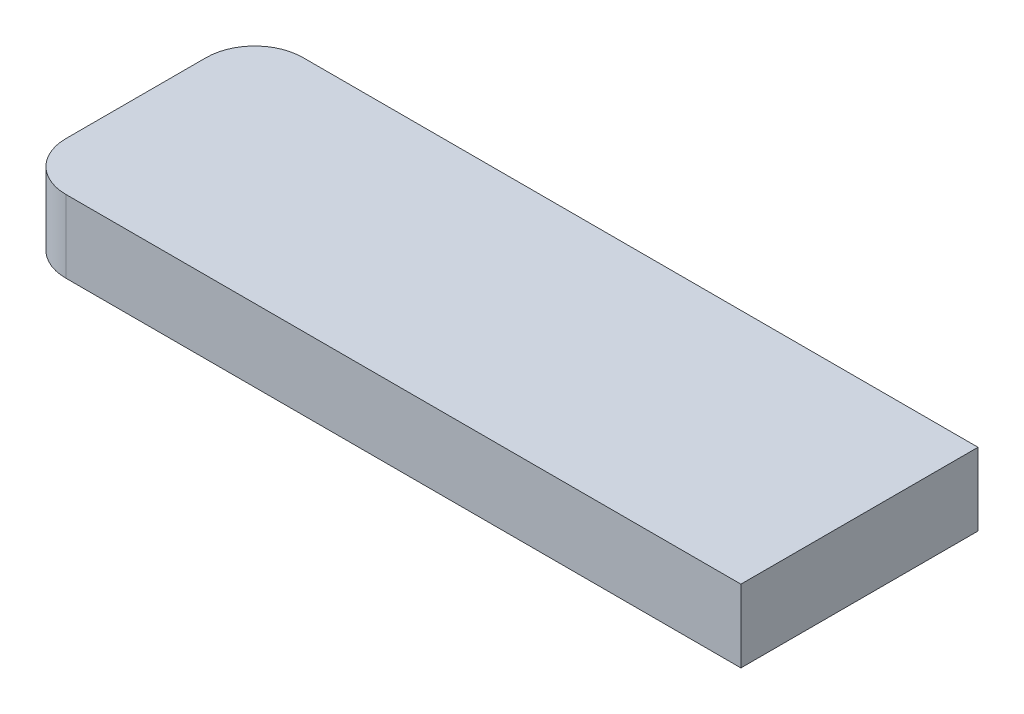
ISO-10303-21;
HEADER;
FILE_DESCRIPTION(('STEP AP214'),'2;1');
FILE_NAME('part.step','',(''),(''),'','','');
FILE_SCHEMA(('AUTOMOTIVE_DESIGN { 1 0 10303 214 1 1 1 1 }'));
ENDSEC;
DATA;
#1=APPLICATION_CONTEXT('core data for automotive mechanical design processes');
#2=APPLICATION_PROTOCOL_DEFINITION('international standard','automotive_design',2000,#1);
#3=PRODUCT_CONTEXT('',#1,'mechanical');
#4=PRODUCT('Part','Part','',(#3));
#5=PRODUCT_RELATED_PRODUCT_CATEGORY('part','',(#4));
#6=PRODUCT_DEFINITION_FORMATION('','',#4);
#7=PRODUCT_DEFINITION_CONTEXT('part definition',#1,'design');
#8=PRODUCT_DEFINITION('design','',#6,#7);
#9=PRODUCT_DEFINITION_SHAPE('','',#8);
#10=(LENGTH_UNIT() NAMED_UNIT(*) SI_UNIT(.MILLI.,.METRE.));
#11=(NAMED_UNIT(*) PLANE_ANGLE_UNIT() SI_UNIT($,.RADIAN.));
#12=(NAMED_UNIT(*) SI_UNIT($,.STERADIAN.) SOLID_ANGLE_UNIT());
#13=UNCERTAINTY_MEASURE_WITH_UNIT(LENGTH_MEASURE(1.E-05),#10,'distance_accuracy_value','');
#14=(GEOMETRIC_REPRESENTATION_CONTEXT(3) GLOBAL_UNCERTAINTY_ASSIGNED_CONTEXT((#13)) GLOBAL_UNIT_ASSIGNED_CONTEXT((#10,
#11,#12)) REPRESENTATION_CONTEXT('',''));
#15=CARTESIAN_POINT('',(0.,0.,0.));
#16=DIRECTION('',(0.,0.,1.));
#17=DIRECTION('',(1.,0.,0.));
#18=AXIS2_PLACEMENT_3D('',#15,#16,#17);
#19=CARTESIAN_POINT('',(300.,1.71683972880179E-13,0.));
#20=DIRECTION('',(-1.,0.,0.));
#21=DIRECTION('',(0.,-1.,0.));
#22=AXIS2_PLACEMENT_3D('',#19,#20,#21);
#23=PLANE('',#22);
#24=DIRECTION('',(0.,1.,0.));
#25=VECTOR('',#24,1.);
#26=CARTESIAN_POINT('',(300.,-120.,22.9));
#27=LINE('',#26,#25);
#28=CARTESIAN_POINT('',(300.,47.,22.9));
#29=VERTEX_POINT('',#28);
#30=CARTESIAN_POINT('',(300.,50.,22.9));
#31=VERTEX_POINT('',#30);
#32=EDGE_CURVE('E85',#29,#31,#27,.T.);
#33=ORIENTED_EDGE('',*,*,#32,.F.);
#34=DIRECTION('',(0.,0.,1.));
#35=VECTOR('',#34,1.);
#36=CARTESIAN_POINT('',(300.,47.,3.));
#37=LINE('',#36,#35);
#38=CARTESIAN_POINT('',(300.,47.,13.1));
#39=VERTEX_POINT('',#38);
#40=EDGE_CURVE('E87',#39,#29,#37,.T.);
#41=ORIENTED_EDGE('',*,*,#40,.F.);
#42=DIRECTION('',(0.,1.,0.));
#43=VECTOR('',#42,1.);
#44=CARTESIAN_POINT('',(300.,-120.,13.1));
#45=LINE('',#44,#43);
#46=CARTESIAN_POINT('',(300.,50.,13.1));
#47=VERTEX_POINT('',#46);
#48=EDGE_CURVE('E11',#39,#47,#45,.T.);
#49=ORIENTED_EDGE('',*,*,#48,.T.);
#50=DIRECTION('',(0.,0.,-1.));
#51=VECTOR('',#50,1.);
#52=CARTESIAN_POINT('',(300.,50.,60.));
#53=LINE('',#52,#51);
#54=EDGE_CURVE('E47',#31,#47,#53,.T.);
#55=ORIENTED_EDGE('',*,*,#54,.F.);
#56=EDGE_LOOP('',(#33,#41,#49,#55));
#57=FACE_BOUND('',#56,.T.);
#58=ADVANCED_FACE('F32',(#57),#23,.F.);
#59=CARTESIAN_POINT('',(300.,47.,3.));
#60=DIRECTION('',(0.,1.,0.));
#61=DIRECTION('',(0.,0.,1.));
#62=AXIS2_PLACEMENT_3D('',#59,#60,#61);
#63=PLANE('',#62);
#64=DIRECTION('',(0.,0.,-1.));
#65=VECTOR('',#64,1.);
#66=CARTESIAN_POINT('',(270.1,47.,3.));
#67=LINE('',#66,#65);
#68=CARTESIAN_POINT('',(270.1,47.,20.9));
#69=VERTEX_POINT('',#68);
#70=CARTESIAN_POINT('',(270.1,47.,15.1));
#71=VERTEX_POINT('',#70);
#72=EDGE_CURVE('E138',#69,#71,#67,.T.);
#73=ORIENTED_EDGE('',*,*,#72,.T.);
#74=CARTESIAN_POINT('',(272.1,47.,15.1));
#75=DIRECTION('',(0.,1.,0.));
#76=DIRECTION('',(0.,0.,1.));
#77=AXIS2_PLACEMENT_3D('',#74,#75,#76);
#78=CIRCLE('',#77,2.);
#79=CARTESIAN_POINT('',(272.1,47.,13.1));
#80=VERTEX_POINT('',#79);
#81=EDGE_CURVE('E121',#71,#80,#78,.F.);
#82=ORIENTED_EDGE('',*,*,#81,.T.);
#83=DIRECTION('',(1.,0.,0.));
#84=VECTOR('',#83,1.);
#85=CARTESIAN_POINT('',(300.,47.,13.1));
#86=LINE('',#85,#84);
#87=EDGE_CURVE('E102',#80,#39,#86,.T.);
#88=ORIENTED_EDGE('',*,*,#87,.T.);
#89=ORIENTED_EDGE('',*,*,#40,.T.);
#90=DIRECTION('',(-1.,0.,0.));
#91=VECTOR('',#90,1.);
#92=CARTESIAN_POINT('',(300.,47.,22.9));
#93=LINE('',#92,#91);
#94=CARTESIAN_POINT('',(272.1,47.,22.9));
#95=VERTEX_POINT('',#94);
#96=EDGE_CURVE('E88',#29,#95,#93,.T.);
#97=ORIENTED_EDGE('',*,*,#96,.T.);
#98=CARTESIAN_POINT('',(272.1,47.,20.9));
#99=DIRECTION('',(0.,1.,0.));
#100=DIRECTION('',(0.,0.,1.));
#101=AXIS2_PLACEMENT_3D('',#98,#99,#100);
#102=CIRCLE('',#101,2.);
#103=EDGE_CURVE('E120',#95,#69,#102,.F.);
#104=ORIENTED_EDGE('',*,*,#103,.T.);
#105=EDGE_LOOP('',(#73,#82,#88,#89,#97,#104));
#106=FACE_BOUND('',#105,.T.);
#107=ADVANCED_FACE('F126',(#106),#63,.F.);
#108=CARTESIAN_POINT('',(-300.,50.,60.));
#109=DIRECTION('',(0.,-1.,0.));
#110=DIRECTION('',(0.,0.,-1.));
#111=AXIS2_PLACEMENT_3D('',#108,#109,#110);
#112=PLANE('',#111);
#113=DIRECTION('',(1.,0.,0.));
#114=VECTOR('',#113,1.);
#115=CARTESIAN_POINT('',(300.,50.,13.1));
#116=LINE('',#115,#114);
#117=CARTESIAN_POINT('',(272.1,50.,13.1));
#118=VERTEX_POINT('',#117);
#119=EDGE_CURVE('E105',#118,#47,#116,.T.);
#120=ORIENTED_EDGE('',*,*,#119,.F.);
#121=CARTESIAN_POINT('',(272.1,50.,15.1));
#122=DIRECTION('',(0.,-1.,0.));
#123=DIRECTION('',(0.,0.,-1.));
#124=AXIS2_PLACEMENT_3D('',#121,#122,#123);
#125=CIRCLE('',#124,2.);
#126=CARTESIAN_POINT('',(270.1,50.,15.1));
#127=VERTEX_POINT('',#126);
#128=EDGE_CURVE('E114',#118,#127,#125,.F.);
#129=ORIENTED_EDGE('',*,*,#128,.T.);
#130=DIRECTION('',(0.,0.,-1.));
#131=VECTOR('',#130,1.);
#132=CARTESIAN_POINT('',(270.1,50.,13.1));
#133=LINE('',#132,#131);
#134=CARTESIAN_POINT('',(270.1,50.,20.9));
#135=VERTEX_POINT('',#134);
#136=EDGE_CURVE('E134',#135,#127,#133,.T.);
#137=ORIENTED_EDGE('',*,*,#136,.F.);
#138=CARTESIAN_POINT('',(272.1,50.,20.9));
#139=DIRECTION('',(0.,-1.,0.));
#140=DIRECTION('',(0.,0.,-1.));
#141=AXIS2_PLACEMENT_3D('',#138,#139,#140);
#142=CIRCLE('',#141,2.);
#143=CARTESIAN_POINT('',(272.1,50.,22.9));
#144=VERTEX_POINT('',#143);
#145=EDGE_CURVE('E101',#135,#144,#142,.F.);
#146=ORIENTED_EDGE('',*,*,#145,.T.);
#147=DIRECTION('',(-1.,0.,0.));
#148=VECTOR('',#147,1.);
#149=CARTESIAN_POINT('',(300.,50.,22.9));
#150=LINE('',#149,#148);
#151=EDGE_CURVE('E94',#31,#144,#150,.T.);
#152=ORIENTED_EDGE('',*,*,#151,.F.);
#153=ORIENTED_EDGE('',*,*,#54,.T.);
#154=EDGE_LOOP('',(#120,#129,#137,#146,#152,#153));
#155=FACE_BOUND('',#154,.T.);
#156=ADVANCED_FACE('F98',(#155),#112,.F.);
#157=CARTESIAN_POINT('',(300.,-120.,22.9));
#158=DIRECTION('',(0.,0.,-1.));
#159=DIRECTION('',(-1.,0.,0.));
#160=AXIS2_PLACEMENT_3D('',#157,#158,#159);
#161=PLANE('',#160);
#162=ORIENTED_EDGE('',*,*,#151,.T.);
#163=DIRECTION('',(0.,-1.,0.));
#164=VECTOR('',#163,1.);
#165=CARTESIAN_POINT('',(272.1,-120.,22.9));
#166=LINE('',#165,#164);
#167=EDGE_CURVE('E35',#144,#95,#166,.T.);
#168=ORIENTED_EDGE('',*,*,#167,.T.);
#169=ORIENTED_EDGE('',*,*,#96,.F.);
#170=ORIENTED_EDGE('',*,*,#32,.T.);
#171=EDGE_LOOP('',(#162,#168,#169,#170));
#172=FACE_BOUND('',#171,.T.);
#173=ADVANCED_FACE('F92',(#172),#161,.F.);
#174=CARTESIAN_POINT('',(300.,-120.,13.1));
#175=DIRECTION('',(0.,0.,1.));
#176=DIRECTION('',(1.,0.,0.));
#177=AXIS2_PLACEMENT_3D('',#174,#175,#176);
#178=PLANE('',#177);
#179=ORIENTED_EDGE('',*,*,#87,.F.);
#180=DIRECTION('',(0.,1.,0.));
#181=VECTOR('',#180,1.);
#182=CARTESIAN_POINT('',(272.1,-120.,13.1));
#183=LINE('',#182,#181);
#184=EDGE_CURVE('E109',#80,#118,#183,.T.);
#185=ORIENTED_EDGE('',*,*,#184,.T.);
#186=ORIENTED_EDGE('',*,*,#119,.T.);
#187=ORIENTED_EDGE('',*,*,#48,.F.);
#188=EDGE_LOOP('',(#179,#185,#186,#187));
#189=FACE_BOUND('',#188,.T.);
#190=ADVANCED_FACE('F129',(#189),#178,.F.);
#191=CARTESIAN_POINT('',(270.1,-120.,13.1));
#192=DIRECTION('',(1.,0.,0.));
#193=DIRECTION('',(0.,0.,-1.));
#194=AXIS2_PLACEMENT_3D('',#191,#192,#193);
#195=PLANE('',#194);
#196=ORIENTED_EDGE('',*,*,#136,.T.);
#197=DIRECTION('',(0.,1.,0.));
#198=VECTOR('',#197,1.);
#199=CARTESIAN_POINT('',(270.1,-120.,15.1));
#200=LINE('',#199,#198);
#201=EDGE_CURVE('E118',#127,#71,#200,.F.);
#202=ORIENTED_EDGE('',*,*,#201,.T.);
#203=ORIENTED_EDGE('',*,*,#72,.F.);
#204=DIRECTION('',(0.,-1.,0.));
#205=VECTOR('',#204,1.);
#206=CARTESIAN_POINT('',(270.1,-120.,20.9));
#207=LINE('',#206,#205);
#208=EDGE_CURVE('E116',#69,#135,#207,.F.);
#209=ORIENTED_EDGE('',*,*,#208,.T.);
#210=EDGE_LOOP('',(#196,#202,#203,#209));
#211=FACE_BOUND('',#210,.T.);
#212=ADVANCED_FACE('F136',(#211),#195,.F.);
#213=CARTESIAN_POINT('',(272.1,-120.,15.1));
#214=DIRECTION('',(0.,1.,0.));
#215=DIRECTION('',(0.,0.,1.));
#216=AXIS2_PLACEMENT_3D('',#213,#214,#215);
#217=CYLINDRICAL_SURFACE('',#216,2.);
#218=ORIENTED_EDGE('',*,*,#81,.F.);
#219=ORIENTED_EDGE('',*,*,#201,.F.);
#220=ORIENTED_EDGE('',*,*,#128,.F.);
#221=ORIENTED_EDGE('',*,*,#184,.F.);
#222=EDGE_LOOP('',(#218,#219,#220,#221));
#223=FACE_BOUND('',#222,.T.);
#224=ADVANCED_FACE('F131',(#223),#217,.T.);
#225=CARTESIAN_POINT('',(272.1,-120.,20.9));
#226=DIRECTION('',(0.,-1.,0.));
#227=DIRECTION('',(0.,0.,-1.));
#228=AXIS2_PLACEMENT_3D('',#225,#226,#227);
#229=CYLINDRICAL_SURFACE('',#228,2.);
#230=ORIENTED_EDGE('',*,*,#145,.F.);
#231=ORIENTED_EDGE('',*,*,#208,.F.);
#232=ORIENTED_EDGE('',*,*,#103,.F.);
#233=ORIENTED_EDGE('',*,*,#167,.F.);
#234=EDGE_LOOP('',(#230,#231,#232,#233));
#235=FACE_BOUND('',#234,.T.);
#236=ADVANCED_FACE('F142',(#235),#229,.T.);
#237=CLOSED_SHELL('',(#58,#107,#156,#173,#190,#212,#224,#236));
#238=MANIFOLD_SOLID_BREP('B2',#237);
#239=ADVANCED_BREP_SHAPE_REPRESENTATION('',(#18,#238),#14);
#240=SHAPE_DEFINITION_REPRESENTATION(#9,#239);
ENDSEC;
END-ISO-10303-21;
